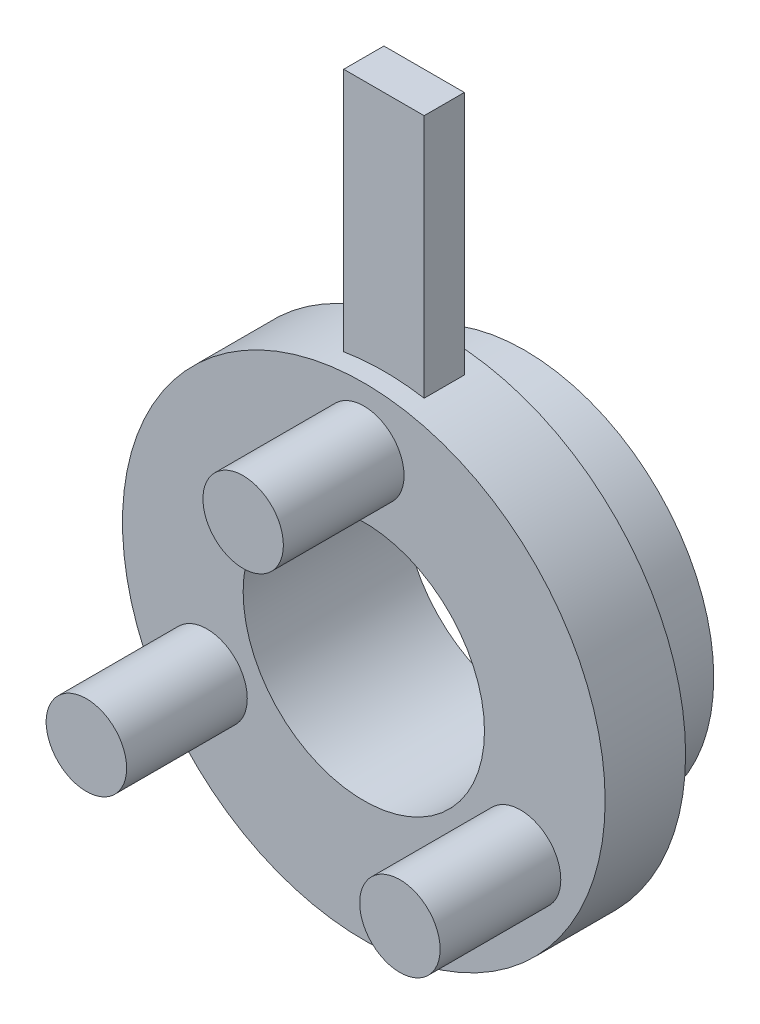
ISO-10303-21;
HEADER;
FILE_DESCRIPTION(('STEP AP214'),'2;1');
FILE_NAME('part.step','',(''),(''),'','','');
FILE_SCHEMA(('AUTOMOTIVE_DESIGN { 1 0 10303 214 1 1 1 1 }'));
ENDSEC;
DATA;
#1=APPLICATION_CONTEXT('core data for automotive mechanical design processes');
#2=APPLICATION_PROTOCOL_DEFINITION('international standard','automotive_design',2000,#1);
#3=PRODUCT_CONTEXT('',#1,'mechanical');
#4=PRODUCT('Part','Part','',(#3));
#5=PRODUCT_RELATED_PRODUCT_CATEGORY('part','',(#4));
#6=PRODUCT_DEFINITION_FORMATION('','',#4);
#7=PRODUCT_DEFINITION_CONTEXT('part definition',#1,'design');
#8=PRODUCT_DEFINITION('design','',#6,#7);
#9=PRODUCT_DEFINITION_SHAPE('','',#8);
#10=(LENGTH_UNIT() NAMED_UNIT(*) SI_UNIT(.MILLI.,.METRE.));
#11=(NAMED_UNIT(*) PLANE_ANGLE_UNIT() SI_UNIT($,.RADIAN.));
#12=(NAMED_UNIT(*) SI_UNIT($,.STERADIAN.) SOLID_ANGLE_UNIT());
#13=UNCERTAINTY_MEASURE_WITH_UNIT(LENGTH_MEASURE(1.E-05),#10,'distance_accuracy_value','');
#14=(GEOMETRIC_REPRESENTATION_CONTEXT(3) GLOBAL_UNCERTAINTY_ASSIGNED_CONTEXT((#13)) GLOBAL_UNIT_ASSIGNED_CONTEXT((#10,
#11,#12)) REPRESENTATION_CONTEXT('',''));
#15=CARTESIAN_POINT('',(0.,0.,0.));
#16=DIRECTION('',(0.,0.,1.));
#17=DIRECTION('',(1.,0.,0.));
#18=AXIS2_PLACEMENT_3D('',#15,#16,#17);
#19=CARTESIAN_POINT('',(0.,0.,10.));
#20=DIRECTION('',(0.,0.,-1.));
#21=DIRECTION('',(-1.,0.,0.));
#22=AXIS2_PLACEMENT_3D('',#19,#20,#21);
#23=CYLINDRICAL_SURFACE('',#22,30.);
#24=CARTESIAN_POINT('',(0.,0.,0.));
#25=DIRECTION('',(0.,0.,1.));
#26=DIRECTION('',(1.,0.,0.));
#27=AXIS2_PLACEMENT_3D('',#24,#25,#26);
#28=CIRCLE('',#27,30.);
#29=CARTESIAN_POINT('',(30.,0.,0.));
#30=VERTEX_POINT('',#29);
#31=EDGE_CURVE('E146',#30,#30,#28,.T.);
#32=ORIENTED_EDGE('',*,*,#31,.T.);
#33=EDGE_LOOP('',(#32));
#34=FACE_BOUND('',#33,.T.);
#35=CARTESIAN_POINT('',(0.,0.,10.));
#36=DIRECTION('',(0.,0.,1.));
#37=DIRECTION('',(1.,0.,0.));
#38=AXIS2_PLACEMENT_3D('',#35,#36,#37);
#39=CIRCLE('',#38,30.);
#40=CARTESIAN_POINT('',(30.,0.,10.));
#41=VERTEX_POINT('',#40);
#42=EDGE_CURVE('E147',#41,#41,#39,.T.);
#43=ORIENTED_EDGE('',*,*,#42,.F.);
#44=EDGE_LOOP('',(#43));
#45=FACE_BOUND('',#44,.T.);
#46=DIRECTION('',(0.,0.,-1.));
#47=VECTOR('',#46,1.);
#48=CARTESIAN_POINT('',(5.,29.5803989154981,10.));
#49=LINE('',#48,#47);
#50=CARTESIAN_POINT('',(5.,29.5803989154981,7.5));
#51=VERTEX_POINT('',#50);
#52=CARTESIAN_POINT('',(5.,29.5803989154981,2.5));
#53=VERTEX_POINT('',#52);
#54=EDGE_CURVE('E11',#51,#53,#49,.T.);
#55=ORIENTED_EDGE('',*,*,#54,.F.);
#56=CARTESIAN_POINT('',(0.,0.,7.5));
#57=DIRECTION('',(0.,0.,-1.));
#58=DIRECTION('',(-1.,0.,0.));
#59=AXIS2_PLACEMENT_3D('',#56,#57,#58);
#60=CIRCLE('',#59,30.);
#61=CARTESIAN_POINT('',(-5.,29.5803989154981,7.5));
#62=VERTEX_POINT('',#61);
#63=EDGE_CURVE('E141',#62,#51,#60,.T.);
#64=ORIENTED_EDGE('',*,*,#63,.F.);
#65=DIRECTION('',(0.,0.,-1.));
#66=VECTOR('',#65,1.);
#67=CARTESIAN_POINT('',(-5.,29.5803989154981,10.));
#68=LINE('',#67,#66);
#69=CARTESIAN_POINT('',(-5.,29.5803989154981,2.5));
#70=VERTEX_POINT('',#69);
#71=EDGE_CURVE('E67',#70,#62,#68,.F.);
#72=ORIENTED_EDGE('',*,*,#71,.F.);
#73=CARTESIAN_POINT('',(0.,0.,2.5));
#74=DIRECTION('',(0.,0.,1.));
#75=DIRECTION('',(1.,0.,0.));
#76=AXIS2_PLACEMENT_3D('',#73,#74,#75);
#77=CIRCLE('',#76,30.);
#78=EDGE_CURVE('E57',#53,#70,#77,.T.);
#79=ORIENTED_EDGE('',*,*,#78,.F.);
#80=EDGE_LOOP('',(#55,#64,#72,#79));
#81=FACE_BOUND('',#80,.T.);
#82=ADVANCED_FACE('F47',(#34,#45,#81),#23,.T.);
#83=CARTESIAN_POINT('',(0.,0.,-10.));
#84=DIRECTION('',(0.,0.,1.));
#85=DIRECTION('',(1.,0.,0.));
#86=AXIS2_PLACEMENT_3D('',#83,#84,#85);
#87=CYLINDRICAL_SURFACE('',#86,23.5);
#88=CARTESIAN_POINT('',(0.,0.,-2.99999999999999));
#89=DIRECTION('',(0.,0.,1.));
#90=DIRECTION('',(1.,0.,0.));
#91=AXIS2_PLACEMENT_3D('',#88,#89,#90);
#92=CIRCLE('',#91,23.5);
#93=CARTESIAN_POINT('',(23.5,0.,-2.99999999999999));
#94=VERTEX_POINT('',#93);
#95=EDGE_CURVE('E142',#94,#94,#92,.F.);
#96=ORIENTED_EDGE('',*,*,#95,.T.);
#97=EDGE_LOOP('',(#96));
#98=FACE_BOUND('',#97,.T.);
#99=CARTESIAN_POINT('',(0.,0.,-10.));
#100=DIRECTION('',(0.,0.,1.));
#101=DIRECTION('',(1.,0.,0.));
#102=AXIS2_PLACEMENT_3D('',#99,#100,#101);
#103=CIRCLE('',#102,23.5);
#104=CARTESIAN_POINT('',(23.5,0.,-10.));
#105=VERTEX_POINT('',#104);
#106=EDGE_CURVE('E158',#105,#105,#103,.T.);
#107=ORIENTED_EDGE('',*,*,#106,.T.);
#108=EDGE_LOOP('',(#107));
#109=FACE_BOUND('',#108,.T.);
#110=ADVANCED_FACE('F189',(#98,#109),#87,.T.);
#111=CARTESIAN_POINT('',(0.,0.,-10.));
#112=DIRECTION('',(0.,0.,1.));
#113=DIRECTION('',(1.,0.,0.));
#114=AXIS2_PLACEMENT_3D('',#111,#112,#113);
#115=PLANE('',#114);
#116=CARTESIAN_POINT('',(0.,0.,-10.));
#117=DIRECTION('',(0.,0.,1.));
#118=DIRECTION('',(1.,0.,0.));
#119=AXIS2_PLACEMENT_3D('',#116,#117,#118);
#120=CIRCLE('',#119,15.);
#121=CARTESIAN_POINT('',(15.,0.,-10.));
#122=VERTEX_POINT('',#121);
#123=EDGE_CURVE('E151',#122,#122,#120,.T.);
#124=ORIENTED_EDGE('',*,*,#123,.T.);
#125=EDGE_LOOP('',(#124));
#126=FACE_BOUND('',#125,.T.);
#127=ORIENTED_EDGE('',*,*,#106,.F.);
#128=EDGE_LOOP('',(#127));
#129=FACE_BOUND('',#128,.T.);
#130=ADVANCED_FACE('F197',(#126,#129),#115,.F.);
#131=CARTESIAN_POINT('',(0.,0.,-10.));
#132=DIRECTION('',(0.,0.,1.));
#133=DIRECTION('',(1.,0.,0.));
#134=AXIS2_PLACEMENT_3D('',#131,#132,#133);
#135=CYLINDRICAL_SURFACE('',#134,15.);
#136=ORIENTED_EDGE('',*,*,#123,.F.);
#137=EDGE_LOOP('',(#136));
#138=FACE_BOUND('',#137,.T.);
#139=CARTESIAN_POINT('',(0.,0.,10.));
#140=DIRECTION('',(0.,0.,1.));
#141=DIRECTION('',(1.,0.,0.));
#142=AXIS2_PLACEMENT_3D('',#139,#140,#141);
#143=CIRCLE('',#142,15.);
#144=CARTESIAN_POINT('',(15.,0.,10.));
#145=VERTEX_POINT('',#144);
#146=EDGE_CURVE('E136',#145,#145,#143,.T.);
#147=ORIENTED_EDGE('',*,*,#146,.T.);
#148=EDGE_LOOP('',(#147));
#149=FACE_BOUND('',#148,.T.);
#150=ADVANCED_FACE('F204',(#138,#149),#135,.F.);
#151=CARTESIAN_POINT('',(0.,0.,10.));
#152=DIRECTION('',(0.,0.,1.));
#153=DIRECTION('',(1.,0.,0.));
#154=AXIS2_PLACEMENT_3D('',#151,#152,#153);
#155=PLANE('',#154);
#156=CARTESIAN_POINT('',(19.4855715851499,-11.25,10.));
#157=DIRECTION('',(0.,0.,1.));
#158=DIRECTION('',(1.,0.,0.));
#159=AXIS2_PLACEMENT_3D('',#156,#157,#158);
#160=CIRCLE('',#159,5.00000000000012);
#161=CARTESIAN_POINT('',(24.48557158515,-11.25,10.));
#162=VERTEX_POINT('',#161);
#163=EDGE_CURVE('E110',#162,#162,#160,.T.);
#164=ORIENTED_EDGE('',*,*,#163,.F.);
#165=EDGE_LOOP('',(#164));
#166=FACE_BOUND('',#165,.T.);
#167=CARTESIAN_POINT('',(0.,22.5,10.));
#168=DIRECTION('',(0.,0.,1.));
#169=DIRECTION('',(1.,0.,0.));
#170=AXIS2_PLACEMENT_3D('',#167,#168,#169);
#171=CIRCLE('',#170,5.);
#172=CARTESIAN_POINT('',(5.,22.5,10.));
#173=VERTEX_POINT('',#172);
#174=EDGE_CURVE('E123',#173,#173,#171,.T.);
#175=ORIENTED_EDGE('',*,*,#174,.F.);
#176=EDGE_LOOP('',(#175));
#177=FACE_BOUND('',#176,.T.);
#178=CARTESIAN_POINT('',(-19.4855715851499,-11.25,10.));
#179=DIRECTION('',(0.,0.,1.));
#180=DIRECTION('',(1.,0.,0.));
#181=AXIS2_PLACEMENT_3D('',#178,#179,#180);
#182=CIRCLE('',#181,5.00000000000021);
#183=CARTESIAN_POINT('',(-14.4855715851497,-11.25,10.));
#184=VERTEX_POINT('',#183);
#185=EDGE_CURVE('E137',#184,#184,#182,.T.);
#186=ORIENTED_EDGE('',*,*,#185,.F.);
#187=EDGE_LOOP('',(#186));
#188=FACE_BOUND('',#187,.T.);
#189=ORIENTED_EDGE('',*,*,#42,.T.);
#190=EDGE_LOOP('',(#189));
#191=FACE_BOUND('',#190,.T.);
#192=ORIENTED_EDGE('',*,*,#146,.F.);
#193=EDGE_LOOP('',(#192));
#194=FACE_BOUND('',#193,.T.);
#195=ADVANCED_FACE('F207',(#166,#177,#188,#191,#194),#155,.T.);
#196=CARTESIAN_POINT('',(0.,0.,0.));
#197=DIRECTION('',(0.,0.,1.));
#198=DIRECTION('',(1.,0.,0.));
#199=AXIS2_PLACEMENT_3D('',#196,#197,#198);
#200=PLANE('',#199);
#201=CARTESIAN_POINT('',(0.,0.,0.));
#202=DIRECTION('',(0.,0.,1.));
#203=DIRECTION('',(1.,0.,0.));
#204=AXIS2_PLACEMENT_3D('',#201,#202,#203);
#205=CIRCLE('',#204,26.5);
#206=CARTESIAN_POINT('',(26.5,0.,0.));
#207=VERTEX_POINT('',#206);
#208=EDGE_CURVE('E162',#207,#207,#205,.T.);
#209=ORIENTED_EDGE('',*,*,#208,.T.);
#210=EDGE_LOOP('',(#209));
#211=FACE_BOUND('',#210,.T.);
#212=ORIENTED_EDGE('',*,*,#31,.F.);
#213=EDGE_LOOP('',(#212));
#214=FACE_BOUND('',#213,.T.);
#215=ADVANCED_FACE('F202',(#211,#214),#200,.F.);
#216=CARTESIAN_POINT('',(0.,0.,0.));
#217=DIRECTION('',(0.,0.,1.));
#218=DIRECTION('',(1.,0.,0.));
#219=AXIS2_PLACEMENT_3D('',#216,#217,#218);
#220=CONICAL_SURFACE('',#219,26.5,0.785398163397452);
#221=ORIENTED_EDGE('',*,*,#95,.F.);
#222=EDGE_LOOP('',(#221));
#223=FACE_BOUND('',#222,.T.);
#224=ORIENTED_EDGE('',*,*,#208,.F.);
#225=EDGE_LOOP('',(#224));
#226=FACE_BOUND('',#225,.T.);
#227=ADVANCED_FACE('F50',(#223,#226),#220,.T.);
#228=CARTESIAN_POINT('',(-19.4855715851499,-11.25,25.));
#229=DIRECTION('',(0.,0.,-1.));
#230=DIRECTION('',(-1.,0.,0.));
#231=AXIS2_PLACEMENT_3D('',#228,#229,#230);
#232=CYLINDRICAL_SURFACE('',#231,5.00000000000021);
#233=CARTESIAN_POINT('',(-19.4855715851499,-11.25,25.));
#234=DIRECTION('',(0.,0.,1.));
#235=DIRECTION('',(1.,0.,0.));
#236=AXIS2_PLACEMENT_3D('',#233,#234,#235);
#237=CIRCLE('',#236,5.00000000000021);
#238=CARTESIAN_POINT('',(-14.4855715851497,-11.25,25.));
#239=VERTEX_POINT('',#238);
#240=EDGE_CURVE('E129',#239,#239,#237,.T.);
#241=ORIENTED_EDGE('',*,*,#240,.F.);
#242=EDGE_LOOP('',(#241));
#243=FACE_BOUND('',#242,.T.);
#244=ORIENTED_EDGE('',*,*,#185,.T.);
#245=EDGE_LOOP('',(#244));
#246=FACE_BOUND('',#245,.T.);
#247=ADVANCED_FACE('F231',(#243,#246),#232,.T.);
#248=CARTESIAN_POINT('',(0.,0.,25.));
#249=DIRECTION('',(0.,0.,1.));
#250=DIRECTION('',(1.,0.,0.));
#251=AXIS2_PLACEMENT_3D('',#248,#249,#250);
#252=PLANE('',#251);
#253=ORIENTED_EDGE('',*,*,#240,.T.);
#254=EDGE_LOOP('',(#253));
#255=FACE_BOUND('',#254,.T.);
#256=ADVANCED_FACE('F233',(#255),#252,.T.);
#257=CARTESIAN_POINT('',(0.,22.5,25.));
#258=DIRECTION('',(0.,0.,-1.));
#259=DIRECTION('',(-1.,0.,0.));
#260=AXIS2_PLACEMENT_3D('',#257,#258,#259);
#261=CYLINDRICAL_SURFACE('',#260,5.);
#262=CARTESIAN_POINT('',(0.,22.5,25.));
#263=DIRECTION('',(0.,0.,1.));
#264=DIRECTION('',(1.,0.,0.));
#265=AXIS2_PLACEMENT_3D('',#262,#263,#264);
#266=CIRCLE('',#265,5.);
#267=CARTESIAN_POINT('',(5.,22.5,25.));
#268=VERTEX_POINT('',#267);
#269=EDGE_CURVE('E125',#268,#268,#266,.T.);
#270=ORIENTED_EDGE('',*,*,#269,.F.);
#271=EDGE_LOOP('',(#270));
#272=FACE_BOUND('',#271,.T.);
#273=ORIENTED_EDGE('',*,*,#174,.T.);
#274=EDGE_LOOP('',(#273));
#275=FACE_BOUND('',#274,.T.);
#276=ADVANCED_FACE('F237',(#272,#275),#261,.T.);
#277=CARTESIAN_POINT('',(0.,0.,25.));
#278=DIRECTION('',(0.,0.,1.));
#279=DIRECTION('',(1.,0.,0.));
#280=AXIS2_PLACEMENT_3D('',#277,#278,#279);
#281=PLANE('',#280);
#282=ORIENTED_EDGE('',*,*,#269,.T.);
#283=EDGE_LOOP('',(#282));
#284=FACE_BOUND('',#283,.T.);
#285=ADVANCED_FACE('F241',(#284),#281,.T.);
#286=CARTESIAN_POINT('',(19.4855715851499,-11.25,25.));
#287=DIRECTION('',(0.,0.,-1.));
#288=DIRECTION('',(-1.,0.,0.));
#289=AXIS2_PLACEMENT_3D('',#286,#287,#288);
#290=CYLINDRICAL_SURFACE('',#289,5.00000000000012);
#291=CARTESIAN_POINT('',(19.4855715851499,-11.25,25.));
#292=DIRECTION('',(0.,0.,1.));
#293=DIRECTION('',(1.,0.,0.));
#294=AXIS2_PLACEMENT_3D('',#291,#292,#293);
#295=CIRCLE('',#294,5.00000000000012);
#296=CARTESIAN_POINT('',(24.48557158515,-11.25,25.));
#297=VERTEX_POINT('',#296);
#298=EDGE_CURVE('E115',#297,#297,#295,.T.);
#299=ORIENTED_EDGE('',*,*,#298,.F.);
#300=EDGE_LOOP('',(#299));
#301=FACE_BOUND('',#300,.T.);
#302=ORIENTED_EDGE('',*,*,#163,.T.);
#303=EDGE_LOOP('',(#302));
#304=FACE_BOUND('',#303,.T.);
#305=ADVANCED_FACE('F245',(#301,#304),#290,.T.);
#306=CARTESIAN_POINT('',(0.,0.,25.));
#307=DIRECTION('',(0.,0.,1.));
#308=DIRECTION('',(1.,0.,0.));
#309=AXIS2_PLACEMENT_3D('',#306,#307,#308);
#310=PLANE('',#309);
#311=ORIENTED_EDGE('',*,*,#298,.T.);
#312=EDGE_LOOP('',(#311));
#313=FACE_BOUND('',#312,.T.);
#314=ADVANCED_FACE('F249',(#313),#310,.T.);
#315=CARTESIAN_POINT('',(5.,60.,2.5));
#316=DIRECTION('',(-1.,0.,0.));
#317=DIRECTION('',(0.,0.,1.));
#318=AXIS2_PLACEMENT_3D('',#315,#316,#317);
#319=PLANE('',#318);
#320=DIRECTION('',(0.,-1.,0.));
#321=VECTOR('',#320,1.);
#322=CARTESIAN_POINT('',(5.,60.,7.5));
#323=LINE('',#322,#321);
#324=CARTESIAN_POINT('',(5.,60.,7.5));
#325=VERTEX_POINT('',#324);
#326=EDGE_CURVE('E181',#325,#51,#323,.T.);
#327=ORIENTED_EDGE('',*,*,#326,.T.);
#328=ORIENTED_EDGE('',*,*,#54,.T.);
#329=DIRECTION('',(0.,-1.,0.));
#330=VECTOR('',#329,1.);
#331=CARTESIAN_POINT('',(5.,60.,2.5));
#332=LINE('',#331,#330);
#333=CARTESIAN_POINT('',(5.,60.,2.5));
#334=VERTEX_POINT('',#333);
#335=EDGE_CURVE('E90',#334,#53,#332,.T.);
#336=ORIENTED_EDGE('',*,*,#335,.F.);
#337=DIRECTION('',(0.,0.,-1.));
#338=VECTOR('',#337,1.);
#339=CARTESIAN_POINT('',(5.,60.,2.5));
#340=LINE('',#339,#338);
#341=EDGE_CURVE('E97',#325,#334,#340,.T.);
#342=ORIENTED_EDGE('',*,*,#341,.F.);
#343=EDGE_LOOP('',(#327,#328,#336,#342));
#344=FACE_BOUND('',#343,.T.);
#345=ADVANCED_FACE('F108',(#344),#319,.F.);
#346=CARTESIAN_POINT('',(-5.,60.,2.5));
#347=DIRECTION('',(1.,0.,0.));
#348=DIRECTION('',(0.,0.,-1.));
#349=AXIS2_PLACEMENT_3D('',#346,#347,#348);
#350=PLANE('',#349);
#351=DIRECTION('',(0.,-1.,0.));
#352=VECTOR('',#351,1.);
#353=CARTESIAN_POINT('',(-5.,60.,2.5));
#354=LINE('',#353,#352);
#355=CARTESIAN_POINT('',(-5.,60.,2.5));
#356=VERTEX_POINT('',#355);
#357=EDGE_CURVE('E92',#356,#70,#354,.T.);
#358=ORIENTED_EDGE('',*,*,#357,.T.);
#359=ORIENTED_EDGE('',*,*,#71,.T.);
#360=DIRECTION('',(0.,-1.,0.));
#361=VECTOR('',#360,1.);
#362=CARTESIAN_POINT('',(-5.,60.,7.5));
#363=LINE('',#362,#361);
#364=CARTESIAN_POINT('',(-5.,60.,7.5));
#365=VERTEX_POINT('',#364);
#366=EDGE_CURVE('E117',#365,#62,#363,.T.);
#367=ORIENTED_EDGE('',*,*,#366,.F.);
#368=DIRECTION('',(0.,0.,1.));
#369=VECTOR('',#368,1.);
#370=CARTESIAN_POINT('',(-5.,60.,2.5));
#371=LINE('',#370,#369);
#372=EDGE_CURVE('E96',#356,#365,#371,.T.);
#373=ORIENTED_EDGE('',*,*,#372,.F.);
#374=EDGE_LOOP('',(#358,#359,#367,#373));
#375=FACE_BOUND('',#374,.T.);
#376=ADVANCED_FACE('F175',(#375),#350,.F.);
#377=CARTESIAN_POINT('',(-5.,60.,2.5));
#378=DIRECTION('',(0.,0.,1.));
#379=DIRECTION('',(1.,0.,0.));
#380=AXIS2_PLACEMENT_3D('',#377,#378,#379);
#381=PLANE('',#380);
#382=ORIENTED_EDGE('',*,*,#335,.T.);
#383=ORIENTED_EDGE('',*,*,#78,.T.);
#384=ORIENTED_EDGE('',*,*,#357,.F.);
#385=DIRECTION('',(-1.,0.,0.));
#386=VECTOR('',#385,1.);
#387=CARTESIAN_POINT('',(-5.,60.,2.5));
#388=LINE('',#387,#386);
#389=EDGE_CURVE('E86',#334,#356,#388,.T.);
#390=ORIENTED_EDGE('',*,*,#389,.F.);
#391=EDGE_LOOP('',(#382,#383,#384,#390));
#392=FACE_BOUND('',#391,.T.);
#393=ADVANCED_FACE('F88',(#392),#381,.F.);
#394=CARTESIAN_POINT('',(-5.,60.,7.5));
#395=DIRECTION('',(0.,0.,-1.));
#396=DIRECTION('',(-1.,0.,0.));
#397=AXIS2_PLACEMENT_3D('',#394,#395,#396);
#398=PLANE('',#397);
#399=ORIENTED_EDGE('',*,*,#366,.T.);
#400=ORIENTED_EDGE('',*,*,#63,.T.);
#401=ORIENTED_EDGE('',*,*,#326,.F.);
#402=DIRECTION('',(1.,0.,0.));
#403=VECTOR('',#402,1.);
#404=CARTESIAN_POINT('',(-5.,60.,7.5));
#405=LINE('',#404,#403);
#406=EDGE_CURVE('E102',#365,#325,#405,.T.);
#407=ORIENTED_EDGE('',*,*,#406,.F.);
#408=EDGE_LOOP('',(#399,#400,#401,#407));
#409=FACE_BOUND('',#408,.T.);
#410=ADVANCED_FACE('F187',(#409),#398,.F.);
#411=CARTESIAN_POINT('',(0.,60.,0.));
#412=DIRECTION('',(0.,1.,0.));
#413=DIRECTION('',(0.,0.,1.));
#414=AXIS2_PLACEMENT_3D('',#411,#412,#413);
#415=PLANE('',#414);
#416=ORIENTED_EDGE('',*,*,#341,.T.);
#417=ORIENTED_EDGE('',*,*,#389,.T.);
#418=ORIENTED_EDGE('',*,*,#372,.T.);
#419=ORIENTED_EDGE('',*,*,#406,.T.);
#420=EDGE_LOOP('',(#416,#417,#418,#419));
#421=FACE_BOUND('',#420,.T.);
#422=ADVANCED_FACE('F100',(#421),#415,.T.);
#423=CLOSED_SHELL('',(#82,#110,#130,#150,#195,#215,#227,#247,#256,#276,#285,#305,#314,#345,#376,
#393,#410,#422));
#424=MANIFOLD_SOLID_BREP('B2',#423);
#425=ADVANCED_BREP_SHAPE_REPRESENTATION('',(#18,#424),#14);
#426=SHAPE_DEFINITION_REPRESENTATION(#9,#425);
ENDSEC;
END-ISO-10303-21;
